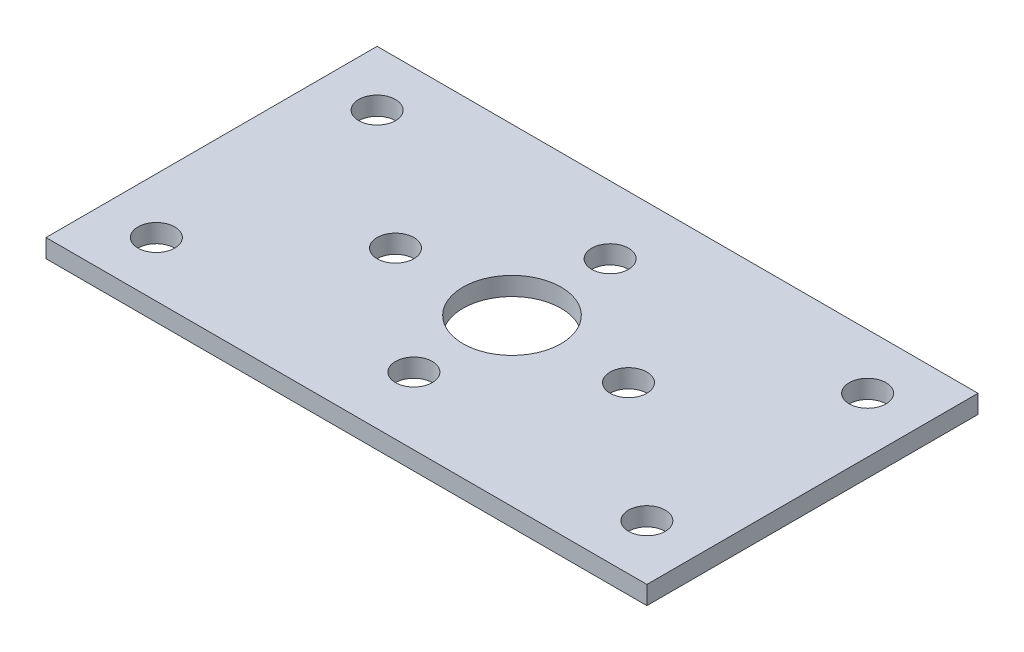
ISO-10303-21;
HEADER;
FILE_DESCRIPTION(('STEP AP214'),'2;1');
FILE_NAME('part.step','',(''),(''),'','','');
FILE_SCHEMA(('AUTOMOTIVE_DESIGN { 1 0 10303 214 1 1 1 1 }'));
ENDSEC;
DATA;
#1=APPLICATION_CONTEXT('core data for automotive mechanical design processes');
#2=APPLICATION_PROTOCOL_DEFINITION('international standard','automotive_design',2000,#1);
#3=PRODUCT_CONTEXT('',#1,'mechanical');
#4=PRODUCT('Part','Part','',(#3));
#5=PRODUCT_RELATED_PRODUCT_CATEGORY('part','',(#4));
#6=PRODUCT_DEFINITION_FORMATION('','',#4);
#7=PRODUCT_DEFINITION_CONTEXT('part definition',#1,'design');
#8=PRODUCT_DEFINITION('design','',#6,#7);
#9=PRODUCT_DEFINITION_SHAPE('','',#8);
#10=(LENGTH_UNIT() NAMED_UNIT(*) SI_UNIT(.MILLI.,.METRE.));
#11=(NAMED_UNIT(*) PLANE_ANGLE_UNIT() SI_UNIT($,.RADIAN.));
#12=(NAMED_UNIT(*) SI_UNIT($,.STERADIAN.) SOLID_ANGLE_UNIT());
#13=UNCERTAINTY_MEASURE_WITH_UNIT(LENGTH_MEASURE(1.E-05),#10,'distance_accuracy_value','');
#14=(GEOMETRIC_REPRESENTATION_CONTEXT(3) GLOBAL_UNCERTAINTY_ASSIGNED_CONTEXT((#13)) GLOBAL_UNIT_ASSIGNED_CONTEXT((#10,
#11,#12)) REPRESENTATION_CONTEXT('',''));
#15=CARTESIAN_POINT('',(0.,0.,0.));
#16=DIRECTION('',(0.,0.,1.));
#17=DIRECTION('',(1.,0.,0.));
#18=AXIS2_PLACEMENT_3D('',#15,#16,#17);
#19=CARTESIAN_POINT('',(0.,1.5,0.));
#20=DIRECTION('',(0.,-1.,0.));
#21=DIRECTION('',(0.,0.,-1.));
#22=AXIS2_PLACEMENT_3D('',#19,#20,#21);
#23=PLANE('',#22);
#24=CARTESIAN_POINT('',(24.5,1.5,-5.5));
#25=DIRECTION('',(0.,-1.,0.));
#26=DIRECTION('',(0.,0.,-1.));
#27=AXIS2_PLACEMENT_3D('',#24,#25,#26);
#28=CIRCLE('',#27,1.5);
#29=CARTESIAN_POINT('',(24.5,1.5,-7.));
#30=VERTEX_POINT('',#29);
#31=EDGE_CURVE('E135',#30,#30,#28,.F.);
#32=ORIENTED_EDGE('',*,*,#31,.F.);
#33=EDGE_LOOP('',(#32));
#34=FACE_BOUND('',#33,.T.);
#35=CARTESIAN_POINT('',(34.,1.5,-13.5));
#36=DIRECTION('',(0.,-1.,0.));
#37=DIRECTION('',(0.,0.,-1.));
#38=AXIS2_PLACEMENT_3D('',#35,#36,#37);
#39=CIRCLE('',#38,1.5);
#40=CARTESIAN_POINT('',(34.,1.5,-15.));
#41=VERTEX_POINT('',#40);
#42=EDGE_CURVE('E128',#41,#41,#39,.F.);
#43=ORIENTED_EDGE('',*,*,#42,.F.);
#44=EDGE_LOOP('',(#43));
#45=FACE_BOUND('',#44,.T.);
#46=CARTESIAN_POINT('',(44.5,1.5,-22.5));
#47=DIRECTION('',(0.,-1.,0.));
#48=DIRECTION('',(0.,0.,-1.));
#49=AXIS2_PLACEMENT_3D('',#46,#47,#48);
#50=CIRCLE('',#49,1.5);
#51=CARTESIAN_POINT('',(44.5,1.5,-24.));
#52=VERTEX_POINT('',#51);
#53=EDGE_CURVE('E120',#52,#52,#50,.F.);
#54=ORIENTED_EDGE('',*,*,#53,.F.);
#55=EDGE_LOOP('',(#54));
#56=FACE_BOUND('',#55,.T.);
#57=CARTESIAN_POINT('',(4.5,1.5,-4.5));
#58=DIRECTION('',(0.,-1.,0.));
#59=DIRECTION('',(0.,0.,-1.));
#60=AXIS2_PLACEMENT_3D('',#57,#58,#59);
#61=CIRCLE('',#60,1.5);
#62=CARTESIAN_POINT('',(4.5,1.5,-6.));
#63=VERTEX_POINT('',#62);
#64=EDGE_CURVE('E112',#63,#63,#61,.F.);
#65=ORIENTED_EDGE('',*,*,#64,.F.);
#66=EDGE_LOOP('',(#65));
#67=FACE_BOUND('',#66,.T.);
#68=DIRECTION('',(0.,0.,1.));
#69=VECTOR('',#68,1.);
#70=CARTESIAN_POINT('',(0.,1.5,0.));
#71=LINE('',#70,#69);
#72=CARTESIAN_POINT('',(0.,1.5,-27.));
#73=VERTEX_POINT('',#72);
#74=CARTESIAN_POINT('',(0.,1.5,0.));
#75=VERTEX_POINT('',#74);
#76=EDGE_CURVE('E87',#73,#75,#71,.T.);
#77=ORIENTED_EDGE('',*,*,#76,.T.);
#78=DIRECTION('',(1.,0.,0.));
#79=VECTOR('',#78,1.);
#80=CARTESIAN_POINT('',(0.,1.5,0.));
#81=LINE('',#80,#79);
#82=CARTESIAN_POINT('',(49.,1.5,0.));
#83=VERTEX_POINT('',#82);
#84=EDGE_CURVE('E82',#75,#83,#81,.T.);
#85=ORIENTED_EDGE('',*,*,#84,.T.);
#86=DIRECTION('',(0.,0.,-1.));
#87=VECTOR('',#86,1.);
#88=CARTESIAN_POINT('',(49.,1.5,0.));
#89=LINE('',#88,#87);
#90=CARTESIAN_POINT('',(49.,1.5,-27.));
#91=VERTEX_POINT('',#90);
#92=EDGE_CURVE('E85',#83,#91,#89,.T.);
#93=ORIENTED_EDGE('',*,*,#92,.T.);
#94=DIRECTION('',(-1.,0.,0.));
#95=VECTOR('',#94,1.);
#96=CARTESIAN_POINT('',(0.,1.5,-27.));
#97=LINE('',#96,#95);
#98=EDGE_CURVE('E52',#91,#73,#97,.T.);
#99=ORIENTED_EDGE('',*,*,#98,.T.);
#100=EDGE_LOOP('',(#77,#85,#93,#99));
#101=FACE_BOUND('',#100,.T.);
#102=CARTESIAN_POINT('',(4.5,1.5,-22.5));
#103=DIRECTION('',(0.,-1.,0.));
#104=DIRECTION('',(0.,0.,-1.));
#105=AXIS2_PLACEMENT_3D('',#102,#103,#104);
#106=CIRCLE('',#105,1.5);
#107=CARTESIAN_POINT('',(4.5,1.5,-24.));
#108=VERTEX_POINT('',#107);
#109=EDGE_CURVE('E103',#108,#108,#106,.F.);
#110=ORIENTED_EDGE('',*,*,#109,.F.);
#111=EDGE_LOOP('',(#110));
#112=FACE_BOUND('',#111,.T.);
#113=CARTESIAN_POINT('',(44.5,1.5,-4.5));
#114=DIRECTION('',(0.,-1.,0.));
#115=DIRECTION('',(0.,0.,-1.));
#116=AXIS2_PLACEMENT_3D('',#113,#114,#115);
#117=CIRCLE('',#116,1.5);
#118=CARTESIAN_POINT('',(44.5,1.5,-6.));
#119=VERTEX_POINT('',#118);
#120=EDGE_CURVE('E116',#119,#119,#117,.F.);
#121=ORIENTED_EDGE('',*,*,#120,.F.);
#122=EDGE_LOOP('',(#121));
#123=FACE_BOUND('',#122,.T.);
#124=CARTESIAN_POINT('',(15.,1.5,-13.5));
#125=DIRECTION('',(0.,-1.,0.));
#126=DIRECTION('',(0.,0.,-1.));
#127=AXIS2_PLACEMENT_3D('',#124,#125,#126);
#128=CIRCLE('',#127,1.5);
#129=CARTESIAN_POINT('',(15.,1.5,-15.));
#130=VERTEX_POINT('',#129);
#131=EDGE_CURVE('E124',#130,#130,#128,.F.);
#132=ORIENTED_EDGE('',*,*,#131,.F.);
#133=EDGE_LOOP('',(#132));
#134=FACE_BOUND('',#133,.T.);
#135=CARTESIAN_POINT('',(24.5,1.5,-21.5));
#136=DIRECTION('',(0.,-1.,0.));
#137=DIRECTION('',(0.,0.,-1.));
#138=AXIS2_PLACEMENT_3D('',#135,#136,#137);
#139=CIRCLE('',#138,1.5);
#140=CARTESIAN_POINT('',(24.5,1.5,-23.));
#141=VERTEX_POINT('',#140);
#142=EDGE_CURVE('E132',#141,#141,#139,.F.);
#143=ORIENTED_EDGE('',*,*,#142,.F.);
#144=EDGE_LOOP('',(#143));
#145=FACE_BOUND('',#144,.T.);
#146=CARTESIAN_POINT('',(24.5,1.5,-13.5));
#147=DIRECTION('',(0.,-1.,0.));
#148=DIRECTION('',(0.,0.,-1.));
#149=AXIS2_PLACEMENT_3D('',#146,#147,#148);
#150=CIRCLE('',#149,4.);
#151=CARTESIAN_POINT('',(24.5,1.5,-17.5));
#152=VERTEX_POINT('',#151);
#153=EDGE_CURVE('E138',#152,#152,#150,.F.);
#154=ORIENTED_EDGE('',*,*,#153,.F.);
#155=EDGE_LOOP('',(#154));
#156=FACE_BOUND('',#155,.T.);
#157=ADVANCED_FACE('F33',(#34,#45,#56,#67,#101,#112,#123,#134,#145,#156),#23,.F.);
#158=CARTESIAN_POINT('',(0.,0.,0.));
#159=DIRECTION('',(0.,-1.,0.));
#160=DIRECTION('',(0.,0.,-1.));
#161=AXIS2_PLACEMENT_3D('',#158,#159,#160);
#162=PLANE('',#161);
#163=CARTESIAN_POINT('',(24.5,0.,-5.5));
#164=DIRECTION('',(0.,-1.,0.));
#165=DIRECTION('',(0.,0.,-1.));
#166=AXIS2_PLACEMENT_3D('',#163,#164,#165);
#167=CIRCLE('',#166,1.5);
#168=CARTESIAN_POINT('',(24.5,0.,-7.));
#169=VERTEX_POINT('',#168);
#170=EDGE_CURVE('E136',#169,#169,#167,.F.);
#171=ORIENTED_EDGE('',*,*,#170,.T.);
#172=EDGE_LOOP('',(#171));
#173=FACE_BOUND('',#172,.T.);
#174=CARTESIAN_POINT('',(34.,0.,-13.5));
#175=DIRECTION('',(0.,-1.,0.));
#176=DIRECTION('',(0.,0.,-1.));
#177=AXIS2_PLACEMENT_3D('',#174,#175,#176);
#178=CIRCLE('',#177,1.5);
#179=CARTESIAN_POINT('',(34.,0.,-15.));
#180=VERTEX_POINT('',#179);
#181=EDGE_CURVE('E129',#180,#180,#178,.F.);
#182=ORIENTED_EDGE('',*,*,#181,.T.);
#183=EDGE_LOOP('',(#182));
#184=FACE_BOUND('',#183,.T.);
#185=CARTESIAN_POINT('',(44.5,0.,-22.5));
#186=DIRECTION('',(0.,-1.,0.));
#187=DIRECTION('',(0.,0.,-1.));
#188=AXIS2_PLACEMENT_3D('',#185,#186,#187);
#189=CIRCLE('',#188,1.5);
#190=CARTESIAN_POINT('',(44.5,0.,-24.));
#191=VERTEX_POINT('',#190);
#192=EDGE_CURVE('E121',#191,#191,#189,.F.);
#193=ORIENTED_EDGE('',*,*,#192,.T.);
#194=EDGE_LOOP('',(#193));
#195=FACE_BOUND('',#194,.T.);
#196=CARTESIAN_POINT('',(4.5,0.,-4.5));
#197=DIRECTION('',(0.,-1.,0.));
#198=DIRECTION('',(0.,0.,-1.));
#199=AXIS2_PLACEMENT_3D('',#196,#197,#198);
#200=CIRCLE('',#199,1.5);
#201=CARTESIAN_POINT('',(4.5,0.,-6.));
#202=VERTEX_POINT('',#201);
#203=EDGE_CURVE('E113',#202,#202,#200,.F.);
#204=ORIENTED_EDGE('',*,*,#203,.T.);
#205=EDGE_LOOP('',(#204));
#206=FACE_BOUND('',#205,.T.);
#207=DIRECTION('',(0.,0.,1.));
#208=VECTOR('',#207,1.);
#209=CARTESIAN_POINT('',(0.,0.,0.));
#210=LINE('',#209,#208);
#211=CARTESIAN_POINT('',(0.,0.,-27.));
#212=VERTEX_POINT('',#211);
#213=CARTESIAN_POINT('',(0.,0.,0.));
#214=VERTEX_POINT('',#213);
#215=EDGE_CURVE('E100',#212,#214,#210,.T.);
#216=ORIENTED_EDGE('',*,*,#215,.F.);
#217=DIRECTION('',(-1.,0.,0.));
#218=VECTOR('',#217,1.);
#219=CARTESIAN_POINT('',(0.,0.,-27.));
#220=LINE('',#219,#218);
#221=CARTESIAN_POINT('',(49.,0.,-27.));
#222=VERTEX_POINT('',#221);
#223=EDGE_CURVE('E75',#222,#212,#220,.T.);
#224=ORIENTED_EDGE('',*,*,#223,.F.);
#225=DIRECTION('',(0.,0.,-1.));
#226=VECTOR('',#225,1.);
#227=CARTESIAN_POINT('',(49.,0.,0.));
#228=LINE('',#227,#226);
#229=CARTESIAN_POINT('',(49.,0.,0.));
#230=VERTEX_POINT('',#229);
#231=EDGE_CURVE('E69',#230,#222,#228,.T.);
#232=ORIENTED_EDGE('',*,*,#231,.F.);
#233=DIRECTION('',(1.,0.,0.));
#234=VECTOR('',#233,1.);
#235=CARTESIAN_POINT('',(0.,0.,0.));
#236=LINE('',#235,#234);
#237=EDGE_CURVE('E91',#214,#230,#236,.T.);
#238=ORIENTED_EDGE('',*,*,#237,.F.);
#239=EDGE_LOOP('',(#216,#224,#232,#238));
#240=FACE_BOUND('',#239,.T.);
#241=CARTESIAN_POINT('',(4.5,0.,-22.5));
#242=DIRECTION('',(0.,-1.,0.));
#243=DIRECTION('',(0.,0.,-1.));
#244=AXIS2_PLACEMENT_3D('',#241,#242,#243);
#245=CIRCLE('',#244,1.5);
#246=CARTESIAN_POINT('',(4.5,0.,-24.));
#247=VERTEX_POINT('',#246);
#248=EDGE_CURVE('E109',#247,#247,#245,.F.);
#249=ORIENTED_EDGE('',*,*,#248,.T.);
#250=EDGE_LOOP('',(#249));
#251=FACE_BOUND('',#250,.T.);
#252=CARTESIAN_POINT('',(44.5,0.,-4.5));
#253=DIRECTION('',(0.,-1.,0.));
#254=DIRECTION('',(0.,0.,-1.));
#255=AXIS2_PLACEMENT_3D('',#252,#253,#254);
#256=CIRCLE('',#255,1.5);
#257=CARTESIAN_POINT('',(44.5,0.,-6.));
#258=VERTEX_POINT('',#257);
#259=EDGE_CURVE('E117',#258,#258,#256,.F.);
#260=ORIENTED_EDGE('',*,*,#259,.T.);
#261=EDGE_LOOP('',(#260));
#262=FACE_BOUND('',#261,.T.);
#263=CARTESIAN_POINT('',(15.,0.,-13.5));
#264=DIRECTION('',(0.,-1.,0.));
#265=DIRECTION('',(0.,0.,-1.));
#266=AXIS2_PLACEMENT_3D('',#263,#264,#265);
#267=CIRCLE('',#266,1.5);
#268=CARTESIAN_POINT('',(15.,0.,-15.));
#269=VERTEX_POINT('',#268);
#270=EDGE_CURVE('E125',#269,#269,#267,.F.);
#271=ORIENTED_EDGE('',*,*,#270,.T.);
#272=EDGE_LOOP('',(#271));
#273=FACE_BOUND('',#272,.T.);
#274=CARTESIAN_POINT('',(24.5,0.,-21.5));
#275=DIRECTION('',(0.,-1.,0.));
#276=DIRECTION('',(0.,0.,-1.));
#277=AXIS2_PLACEMENT_3D('',#274,#275,#276);
#278=CIRCLE('',#277,1.5);
#279=CARTESIAN_POINT('',(24.5,0.,-23.));
#280=VERTEX_POINT('',#279);
#281=EDGE_CURVE('E133',#280,#280,#278,.F.);
#282=ORIENTED_EDGE('',*,*,#281,.T.);
#283=EDGE_LOOP('',(#282));
#284=FACE_BOUND('',#283,.T.);
#285=CARTESIAN_POINT('',(24.5,0.,-13.5));
#286=DIRECTION('',(0.,-1.,0.));
#287=DIRECTION('',(0.,0.,-1.));
#288=AXIS2_PLACEMENT_3D('',#285,#286,#287);
#289=CIRCLE('',#288,4.);
#290=CARTESIAN_POINT('',(24.5,0.,-17.5));
#291=VERTEX_POINT('',#290);
#292=EDGE_CURVE('E37',#291,#291,#289,.F.);
#293=ORIENTED_EDGE('',*,*,#292,.T.);
#294=EDGE_LOOP('',(#293));
#295=FACE_BOUND('',#294,.T.);
#296=ADVANCED_FACE('F167',(#173,#184,#195,#206,#240,#251,#262,#273,#284,#295),#162,.T.);
#297=CARTESIAN_POINT('',(0.,1.5,0.));
#298=DIRECTION('',(1.,0.,0.));
#299=DIRECTION('',(0.,0.,-1.));
#300=AXIS2_PLACEMENT_3D('',#297,#298,#299);
#301=PLANE('',#300);
#302=ORIENTED_EDGE('',*,*,#215,.T.);
#303=DIRECTION('',(0.,-1.,0.));
#304=VECTOR('',#303,1.);
#305=CARTESIAN_POINT('',(0.,1.5,0.));
#306=LINE('',#305,#304);
#307=EDGE_CURVE('E11',#75,#214,#306,.T.);
#308=ORIENTED_EDGE('',*,*,#307,.F.);
#309=ORIENTED_EDGE('',*,*,#76,.F.);
#310=DIRECTION('',(0.,-1.,0.));
#311=VECTOR('',#310,1.);
#312=CARTESIAN_POINT('',(0.,1.5,-27.));
#313=LINE('',#312,#311);
#314=EDGE_CURVE('E96',#73,#212,#313,.T.);
#315=ORIENTED_EDGE('',*,*,#314,.T.);
#316=EDGE_LOOP('',(#302,#308,#309,#315));
#317=FACE_BOUND('',#316,.T.);
#318=ADVANCED_FACE('F35',(#317),#301,.F.);
#319=CARTESIAN_POINT('',(0.,1.5,0.));
#320=DIRECTION('',(0.,0.,-1.));
#321=DIRECTION('',(-1.,0.,0.));
#322=AXIS2_PLACEMENT_3D('',#319,#320,#321);
#323=PLANE('',#322);
#324=ORIENTED_EDGE('',*,*,#237,.T.);
#325=DIRECTION('',(0.,-1.,0.));
#326=VECTOR('',#325,1.);
#327=CARTESIAN_POINT('',(49.,1.5,0.));
#328=LINE('',#327,#326);
#329=EDGE_CURVE('E43',#83,#230,#328,.T.);
#330=ORIENTED_EDGE('',*,*,#329,.F.);
#331=ORIENTED_EDGE('',*,*,#84,.F.);
#332=ORIENTED_EDGE('',*,*,#307,.T.);
#333=EDGE_LOOP('',(#324,#330,#331,#332));
#334=FACE_BOUND('',#333,.T.);
#335=ADVANCED_FACE('F90',(#334),#323,.F.);
#336=CARTESIAN_POINT('',(49.,1.5,0.));
#337=DIRECTION('',(-1.,0.,0.));
#338=DIRECTION('',(0.,0.,1.));
#339=AXIS2_PLACEMENT_3D('',#336,#337,#338);
#340=PLANE('',#339);
#341=ORIENTED_EDGE('',*,*,#231,.T.);
#342=DIRECTION('',(0.,-1.,0.));
#343=VECTOR('',#342,1.);
#344=CARTESIAN_POINT('',(49.,1.5,-27.));
#345=LINE('',#344,#343);
#346=EDGE_CURVE('E92',#91,#222,#345,.T.);
#347=ORIENTED_EDGE('',*,*,#346,.F.);
#348=ORIENTED_EDGE('',*,*,#92,.F.);
#349=ORIENTED_EDGE('',*,*,#329,.T.);
#350=EDGE_LOOP('',(#341,#347,#348,#349));
#351=FACE_BOUND('',#350,.T.);
#352=ADVANCED_FACE('F94',(#351),#340,.F.);
#353=CARTESIAN_POINT('',(0.,1.5,-27.));
#354=DIRECTION('',(0.,0.,1.));
#355=DIRECTION('',(1.,0.,0.));
#356=AXIS2_PLACEMENT_3D('',#353,#354,#355);
#357=PLANE('',#356);
#358=ORIENTED_EDGE('',*,*,#223,.T.);
#359=ORIENTED_EDGE('',*,*,#314,.F.);
#360=ORIENTED_EDGE('',*,*,#98,.F.);
#361=ORIENTED_EDGE('',*,*,#346,.T.);
#362=EDGE_LOOP('',(#358,#359,#360,#361));
#363=FACE_BOUND('',#362,.T.);
#364=ADVANCED_FACE('F212',(#363),#357,.F.);
#365=CARTESIAN_POINT('',(4.5,11.5,-22.5));
#366=DIRECTION('',(0.,-1.,0.));
#367=DIRECTION('',(0.,0.,-1.));
#368=AXIS2_PLACEMENT_3D('',#365,#366,#367);
#369=CYLINDRICAL_SURFACE('',#368,1.5);
#370=ORIENTED_EDGE('',*,*,#248,.F.);
#371=EDGE_LOOP('',(#370));
#372=FACE_BOUND('',#371,.T.);
#373=ORIENTED_EDGE('',*,*,#109,.T.);
#374=EDGE_LOOP('',(#373));
#375=FACE_BOUND('',#374,.T.);
#376=ADVANCED_FACE('F164',(#372,#375),#369,.F.);
#377=CARTESIAN_POINT('',(4.5,11.5,-4.5));
#378=DIRECTION('',(0.,-1.,0.));
#379=DIRECTION('',(0.,0.,-1.));
#380=AXIS2_PLACEMENT_3D('',#377,#378,#379);
#381=CYLINDRICAL_SURFACE('',#380,1.5);
#382=ORIENTED_EDGE('',*,*,#203,.F.);
#383=EDGE_LOOP('',(#382));
#384=FACE_BOUND('',#383,.T.);
#385=ORIENTED_EDGE('',*,*,#64,.T.);
#386=EDGE_LOOP('',(#385));
#387=FACE_BOUND('',#386,.T.);
#388=ADVANCED_FACE('F206',(#384,#387),#381,.F.);
#389=CARTESIAN_POINT('',(44.5,11.5,-4.5));
#390=DIRECTION('',(0.,-1.,0.));
#391=DIRECTION('',(0.,0.,-1.));
#392=AXIS2_PLACEMENT_3D('',#389,#390,#391);
#393=CYLINDRICAL_SURFACE('',#392,1.5);
#394=ORIENTED_EDGE('',*,*,#259,.F.);
#395=EDGE_LOOP('',(#394));
#396=FACE_BOUND('',#395,.T.);
#397=ORIENTED_EDGE('',*,*,#120,.T.);
#398=EDGE_LOOP('',(#397));
#399=FACE_BOUND('',#398,.T.);
#400=ADVANCED_FACE('F202',(#396,#399),#393,.F.);
#401=CARTESIAN_POINT('',(44.5,11.5,-22.5));
#402=DIRECTION('',(0.,-1.,0.));
#403=DIRECTION('',(0.,0.,-1.));
#404=AXIS2_PLACEMENT_3D('',#401,#402,#403);
#405=CYLINDRICAL_SURFACE('',#404,1.5);
#406=ORIENTED_EDGE('',*,*,#192,.F.);
#407=EDGE_LOOP('',(#406));
#408=FACE_BOUND('',#407,.T.);
#409=ORIENTED_EDGE('',*,*,#53,.T.);
#410=EDGE_LOOP('',(#409));
#411=FACE_BOUND('',#410,.T.);
#412=ADVANCED_FACE('F198',(#408,#411),#405,.F.);
#413=CARTESIAN_POINT('',(15.,11.5,-13.5));
#414=DIRECTION('',(0.,-1.,0.));
#415=DIRECTION('',(0.,0.,-1.));
#416=AXIS2_PLACEMENT_3D('',#413,#414,#415);
#417=CYLINDRICAL_SURFACE('',#416,1.5);
#418=ORIENTED_EDGE('',*,*,#270,.F.);
#419=EDGE_LOOP('',(#418));
#420=FACE_BOUND('',#419,.T.);
#421=ORIENTED_EDGE('',*,*,#131,.T.);
#422=EDGE_LOOP('',(#421));
#423=FACE_BOUND('',#422,.T.);
#424=ADVANCED_FACE('F190',(#420,#423),#417,.F.);
#425=CARTESIAN_POINT('',(34.,11.5,-13.5));
#426=DIRECTION('',(0.,-1.,0.));
#427=DIRECTION('',(0.,0.,-1.));
#428=AXIS2_PLACEMENT_3D('',#425,#426,#427);
#429=CYLINDRICAL_SURFACE('',#428,1.5);
#430=ORIENTED_EDGE('',*,*,#181,.F.);
#431=EDGE_LOOP('',(#430));
#432=FACE_BOUND('',#431,.T.);
#433=ORIENTED_EDGE('',*,*,#42,.T.);
#434=EDGE_LOOP('',(#433));
#435=FACE_BOUND('',#434,.T.);
#436=ADVANCED_FACE('F180',(#432,#435),#429,.F.);
#437=CARTESIAN_POINT('',(24.5,11.5,-21.5));
#438=DIRECTION('',(0.,-1.,0.));
#439=DIRECTION('',(0.,0.,-1.));
#440=AXIS2_PLACEMENT_3D('',#437,#438,#439);
#441=CYLINDRICAL_SURFACE('',#440,1.5);
#442=ORIENTED_EDGE('',*,*,#281,.F.);
#443=EDGE_LOOP('',(#442));
#444=FACE_BOUND('',#443,.T.);
#445=ORIENTED_EDGE('',*,*,#142,.T.);
#446=EDGE_LOOP('',(#445));
#447=FACE_BOUND('',#446,.T.);
#448=ADVANCED_FACE('F177',(#444,#447),#441,.F.);
#449=CARTESIAN_POINT('',(24.5,11.5,-5.5));
#450=DIRECTION('',(0.,-1.,0.));
#451=DIRECTION('',(0.,0.,-1.));
#452=AXIS2_PLACEMENT_3D('',#449,#450,#451);
#453=CYLINDRICAL_SURFACE('',#452,1.5);
#454=ORIENTED_EDGE('',*,*,#170,.F.);
#455=EDGE_LOOP('',(#454));
#456=FACE_BOUND('',#455,.T.);
#457=ORIENTED_EDGE('',*,*,#31,.T.);
#458=EDGE_LOOP('',(#457));
#459=FACE_BOUND('',#458,.T.);
#460=ADVANCED_FACE('F179',(#456,#459),#453,.F.);
#461=CARTESIAN_POINT('',(24.5,11.5,-13.5));
#462=DIRECTION('',(0.,-1.,0.));
#463=DIRECTION('',(0.,0.,-1.));
#464=AXIS2_PLACEMENT_3D('',#461,#462,#463);
#465=CYLINDRICAL_SURFACE('',#464,4.);
#466=ORIENTED_EDGE('',*,*,#292,.F.);
#467=EDGE_LOOP('',(#466));
#468=FACE_BOUND('',#467,.T.);
#469=ORIENTED_EDGE('',*,*,#153,.T.);
#470=EDGE_LOOP('',(#469));
#471=FACE_BOUND('',#470,.T.);
#472=ADVANCED_FACE('F187',(#468,#471),#465,.F.);
#473=CLOSED_SHELL('',(#157,#296,#318,#335,#352,#364,#376,#388,#400,#412,#424,#436,#448,#460,#472));
#474=MANIFOLD_SOLID_BREP('B2',#473);
#475=ADVANCED_BREP_SHAPE_REPRESENTATION('',(#18,#474),#14);
#476=SHAPE_DEFINITION_REPRESENTATION(#9,#475);
ENDSEC;
END-ISO-10303-21;
